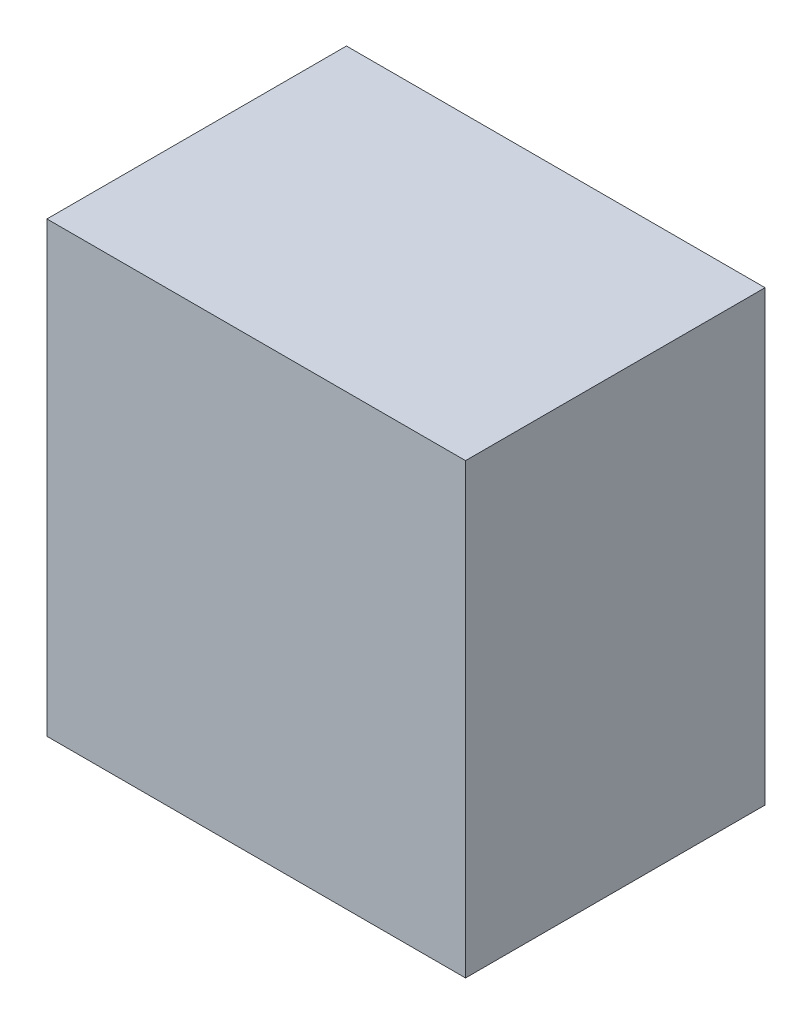
ISO-10303-21;
HEADER;
FILE_DESCRIPTION(('STEP AP214'),'2;1');
FILE_NAME('part.step','',(''),(''),'','','');
FILE_SCHEMA(('AUTOMOTIVE_DESIGN { 1 0 10303 214 1 1 1 1 }'));
ENDSEC;
DATA;
#1=APPLICATION_CONTEXT('core data for automotive mechanical design processes');
#2=APPLICATION_PROTOCOL_DEFINITION('international standard','automotive_design',2000,#1);
#3=PRODUCT_CONTEXT('',#1,'mechanical');
#4=PRODUCT('Part','Part','',(#3));
#5=PRODUCT_RELATED_PRODUCT_CATEGORY('part','',(#4));
#6=PRODUCT_DEFINITION_FORMATION('','',#4);
#7=PRODUCT_DEFINITION_CONTEXT('part definition',#1,'design');
#8=PRODUCT_DEFINITION('design','',#6,#7);
#9=PRODUCT_DEFINITION_SHAPE('','',#8);
#10=(LENGTH_UNIT() NAMED_UNIT(*) SI_UNIT(.MILLI.,.METRE.));
#11=(NAMED_UNIT(*) PLANE_ANGLE_UNIT() SI_UNIT($,.RADIAN.));
#12=(NAMED_UNIT(*) SI_UNIT($,.STERADIAN.) SOLID_ANGLE_UNIT());
#13=UNCERTAINTY_MEASURE_WITH_UNIT(LENGTH_MEASURE(1.E-05),#10,'distance_accuracy_value','');
#14=(GEOMETRIC_REPRESENTATION_CONTEXT(3) GLOBAL_UNCERTAINTY_ASSIGNED_CONTEXT((#13)) GLOBAL_UNIT_ASSIGNED_CONTEXT((#10,
#11,#12)) REPRESENTATION_CONTEXT('',''));
#15=CARTESIAN_POINT('',(0.,0.,0.));
#16=DIRECTION('',(0.,0.,1.));
#17=DIRECTION('',(1.,0.,0.));
#18=AXIS2_PLACEMENT_3D('',#15,#16,#17);
#19=CARTESIAN_POINT('',(35.0012,74.93,25.0444));
#20=DIRECTION('',(-1.,0.,0.));
#21=DIRECTION('',(0.,0.,1.));
#22=AXIS2_PLACEMENT_3D('',#19,#20,#21);
#23=PLANE('',#22);
#24=DIRECTION('',(0.,0.,-1.));
#25=VECTOR('',#24,1.);
#26=CARTESIAN_POINT('',(35.0012,0.,25.0444));
#27=LINE('',#26,#25);
#28=CARTESIAN_POINT('',(35.0012,0.,25.0444));
#29=VERTEX_POINT('',#28);
#30=CARTESIAN_POINT('',(35.0012,0.,-25.0444));
#31=VERTEX_POINT('',#30);
#32=EDGE_CURVE('E98',#29,#31,#27,.T.);
#33=ORIENTED_EDGE('',*,*,#32,.T.);
#34=DIRECTION('',(0.,-1.,0.));
#35=VECTOR('',#34,1.);
#36=CARTESIAN_POINT('',(35.0012,74.93,-25.0444));
#37=LINE('',#36,#35);
#38=CARTESIAN_POINT('',(35.0012,74.93,-25.0444));
#39=VERTEX_POINT('',#38);
#40=EDGE_CURVE('E11',#39,#31,#37,.T.);
#41=ORIENTED_EDGE('',*,*,#40,.F.);
#42=DIRECTION('',(0.,0.,-1.));
#43=VECTOR('',#42,1.);
#44=CARTESIAN_POINT('',(35.0012,74.93,25.0444));
#45=LINE('',#44,#43);
#46=CARTESIAN_POINT('',(35.0012,74.93,25.0444));
#47=VERTEX_POINT('',#46);
#48=EDGE_CURVE('E86',#47,#39,#45,.T.);
#49=ORIENTED_EDGE('',*,*,#48,.F.);
#50=DIRECTION('',(0.,-1.,0.));
#51=VECTOR('',#50,1.);
#52=CARTESIAN_POINT('',(35.0012,74.93,25.0444));
#53=LINE('',#52,#51);
#54=EDGE_CURVE('E94',#47,#29,#53,.T.);
#55=ORIENTED_EDGE('',*,*,#54,.T.);
#56=EDGE_LOOP('',(#33,#41,#49,#55));
#57=FACE_BOUND('',#56,.T.);
#58=ADVANCED_FACE('F35',(#57),#23,.F.);
#59=CARTESIAN_POINT('',(-35.0012,74.93,-25.0444));
#60=DIRECTION('',(0.,0.,1.));
#61=DIRECTION('',(1.,0.,0.));
#62=AXIS2_PLACEMENT_3D('',#59,#60,#61);
#63=PLANE('',#62);
#64=DIRECTION('',(-1.,0.,0.));
#65=VECTOR('',#64,1.);
#66=CARTESIAN_POINT('',(-35.0012,0.,-25.0444));
#67=LINE('',#66,#65);
#68=CARTESIAN_POINT('',(-35.0012,0.,-25.0444));
#69=VERTEX_POINT('',#68);
#70=EDGE_CURVE('E90',#31,#69,#67,.T.);
#71=ORIENTED_EDGE('',*,*,#70,.T.);
#72=DIRECTION('',(0.,-1.,0.));
#73=VECTOR('',#72,1.);
#74=CARTESIAN_POINT('',(-35.0012,74.93,-25.0444));
#75=LINE('',#74,#73);
#76=CARTESIAN_POINT('',(-35.0012,74.93,-25.0444));
#77=VERTEX_POINT('',#76);
#78=EDGE_CURVE('E43',#77,#69,#75,.T.);
#79=ORIENTED_EDGE('',*,*,#78,.F.);
#80=DIRECTION('',(-1.,0.,0.));
#81=VECTOR('',#80,1.);
#82=CARTESIAN_POINT('',(-35.0012,74.93,-25.0444));
#83=LINE('',#82,#81);
#84=EDGE_CURVE('E81',#39,#77,#83,.T.);
#85=ORIENTED_EDGE('',*,*,#84,.F.);
#86=ORIENTED_EDGE('',*,*,#40,.T.);
#87=EDGE_LOOP('',(#71,#79,#85,#86));
#88=FACE_BOUND('',#87,.T.);
#89=ADVANCED_FACE('F89',(#88),#63,.F.);
#90=CARTESIAN_POINT('',(-35.0012,74.93,25.0444));
#91=DIRECTION('',(1.,0.,0.));
#92=DIRECTION('',(0.,0.,-1.));
#93=AXIS2_PLACEMENT_3D('',#90,#91,#92);
#94=PLANE('',#93);
#95=DIRECTION('',(0.,0.,1.));
#96=VECTOR('',#95,1.);
#97=CARTESIAN_POINT('',(-35.0012,0.,25.0444));
#98=LINE('',#97,#96);
#99=CARTESIAN_POINT('',(-35.0012,0.,25.0444));
#100=VERTEX_POINT('',#99);
#101=EDGE_CURVE('E68',#69,#100,#98,.T.);
#102=ORIENTED_EDGE('',*,*,#101,.T.);
#103=DIRECTION('',(0.,-1.,0.));
#104=VECTOR('',#103,1.);
#105=CARTESIAN_POINT('',(-35.0012,74.93,25.0444));
#106=LINE('',#105,#104);
#107=CARTESIAN_POINT('',(-35.0012,74.93,25.0444));
#108=VERTEX_POINT('',#107);
#109=EDGE_CURVE('E91',#108,#100,#106,.T.);
#110=ORIENTED_EDGE('',*,*,#109,.F.);
#111=DIRECTION('',(0.,0.,1.));
#112=VECTOR('',#111,1.);
#113=CARTESIAN_POINT('',(-35.0012,74.93,25.0444));
#114=LINE('',#113,#112);
#115=EDGE_CURVE('E84',#77,#108,#114,.T.);
#116=ORIENTED_EDGE('',*,*,#115,.F.);
#117=ORIENTED_EDGE('',*,*,#78,.T.);
#118=EDGE_LOOP('',(#102,#110,#116,#117));
#119=FACE_BOUND('',#118,.T.);
#120=ADVANCED_FACE('F92',(#119),#94,.F.);
#121=CARTESIAN_POINT('',(-35.0012,74.93,25.0444));
#122=DIRECTION('',(0.,0.,-1.));
#123=DIRECTION('',(-1.,0.,0.));
#124=AXIS2_PLACEMENT_3D('',#121,#122,#123);
#125=PLANE('',#124);
#126=DIRECTION('',(1.,0.,0.));
#127=VECTOR('',#126,1.);
#128=CARTESIAN_POINT('',(-35.0012,0.,25.0444));
#129=LINE('',#128,#127);
#130=EDGE_CURVE('E74',#100,#29,#129,.T.);
#131=ORIENTED_EDGE('',*,*,#130,.T.);
#132=ORIENTED_EDGE('',*,*,#54,.F.);
#133=DIRECTION('',(1.,0.,0.));
#134=VECTOR('',#133,1.);
#135=CARTESIAN_POINT('',(-35.0012,74.93,25.0444));
#136=LINE('',#135,#134);
#137=EDGE_CURVE('E51',#108,#47,#136,.T.);
#138=ORIENTED_EDGE('',*,*,#137,.F.);
#139=ORIENTED_EDGE('',*,*,#109,.T.);
#140=EDGE_LOOP('',(#131,#132,#138,#139));
#141=FACE_BOUND('',#140,.T.);
#142=ADVANCED_FACE('F105',(#141),#125,.F.);
#143=CARTESIAN_POINT('',(0.,74.93,0.));
#144=DIRECTION('',(0.,-1.,0.));
#145=DIRECTION('',(0.,0.,-1.));
#146=AXIS2_PLACEMENT_3D('',#143,#144,#145);
#147=PLANE('',#146);
#148=ORIENTED_EDGE('',*,*,#48,.T.);
#149=ORIENTED_EDGE('',*,*,#84,.T.);
#150=ORIENTED_EDGE('',*,*,#115,.T.);
#151=ORIENTED_EDGE('',*,*,#137,.T.);
#152=EDGE_LOOP('',(#148,#149,#150,#151));
#153=FACE_BOUND('',#152,.T.);
#154=ADVANCED_FACE('F82',(#153),#147,.F.);
#155=CARTESIAN_POINT('',(0.,0.,0.));
#156=DIRECTION('',(0.,-1.,0.));
#157=DIRECTION('',(0.,0.,-1.));
#158=AXIS2_PLACEMENT_3D('',#155,#156,#157);
#159=PLANE('',#158);
#160=ORIENTED_EDGE('',*,*,#32,.F.);
#161=ORIENTED_EDGE('',*,*,#130,.F.);
#162=ORIENTED_EDGE('',*,*,#101,.F.);
#163=ORIENTED_EDGE('',*,*,#70,.F.);
#164=EDGE_LOOP('',(#160,#161,#162,#163));
#165=FACE_BOUND('',#164,.T.);
#166=ADVANCED_FACE('F108',(#165),#159,.T.);
#167=CLOSED_SHELL('',(#58,#89,#120,#142,#154,#166));
#168=MANIFOLD_SOLID_BREP('B2',#167);
#169=ADVANCED_BREP_SHAPE_REPRESENTATION('',(#18,#168),#14);
#170=SHAPE_DEFINITION_REPRESENTATION(#9,#169);
ENDSEC;
END-ISO-10303-21;
